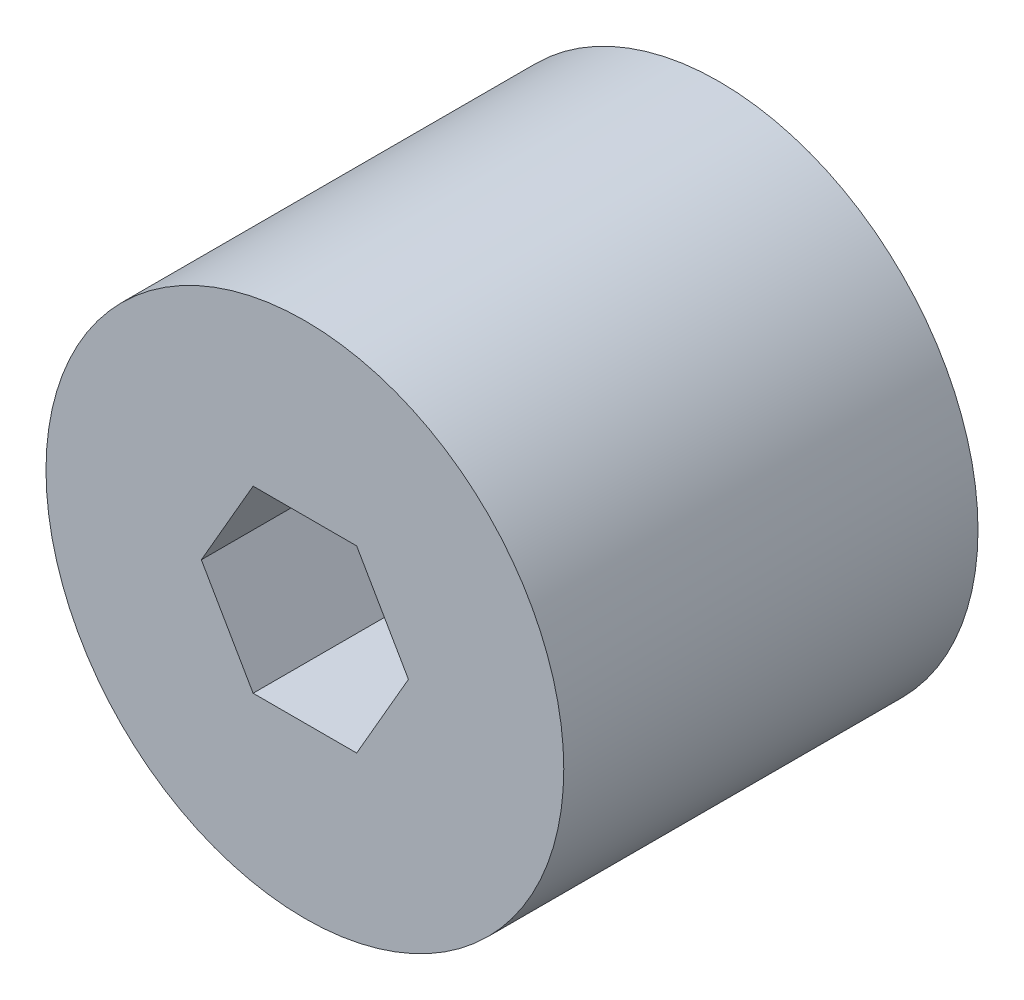
ISO-10303-21;
HEADER;
FILE_DESCRIPTION(('STEP AP214'),'2;1');
FILE_NAME('part.step','',(''),(''),'','','');
FILE_SCHEMA(('AUTOMOTIVE_DESIGN { 1 0 10303 214 1 1 1 1 }'));
ENDSEC;
DATA;
#1=APPLICATION_CONTEXT('core data for automotive mechanical design processes');
#2=APPLICATION_PROTOCOL_DEFINITION('international standard','automotive_design',2000,#1);
#3=PRODUCT_CONTEXT('',#1,'mechanical');
#4=PRODUCT('Part','Part','',(#3));
#5=PRODUCT_RELATED_PRODUCT_CATEGORY('part','',(#4));
#6=PRODUCT_DEFINITION_FORMATION('','',#4);
#7=PRODUCT_DEFINITION_CONTEXT('part definition',#1,'design');
#8=PRODUCT_DEFINITION('design','',#6,#7);
#9=PRODUCT_DEFINITION_SHAPE('','',#8);
#10=(LENGTH_UNIT() NAMED_UNIT(*) SI_UNIT(.MILLI.,.METRE.));
#11=(NAMED_UNIT(*) PLANE_ANGLE_UNIT() SI_UNIT($,.RADIAN.));
#12=(NAMED_UNIT(*) SI_UNIT($,.STERADIAN.) SOLID_ANGLE_UNIT());
#13=UNCERTAINTY_MEASURE_WITH_UNIT(LENGTH_MEASURE(1.E-05),#10,'distance_accuracy_value','');
#14=(GEOMETRIC_REPRESENTATION_CONTEXT(3) GLOBAL_UNCERTAINTY_ASSIGNED_CONTEXT((#13)) GLOBAL_UNIT_ASSIGNED_CONTEXT((#10,
#11,#12)) REPRESENTATION_CONTEXT('',''));
#15=CARTESIAN_POINT('',(0.,0.,0.));
#16=DIRECTION('',(0.,0.,1.));
#17=DIRECTION('',(1.,0.,0.));
#18=AXIS2_PLACEMENT_3D('',#15,#16,#17);
#19=CARTESIAN_POINT('',(0.,0.,25.4));
#20=DIRECTION('',(0.,0.,-1.));
#21=DIRECTION('',(-1.,0.,0.));
#22=AXIS2_PLACEMENT_3D('',#19,#20,#21);
#23=CYLINDRICAL_SURFACE('',#22,15.875);
#24=CARTESIAN_POINT('',(0.,0.,25.4));
#25=DIRECTION('',(0.,0.,1.));
#26=DIRECTION('',(1.,0.,0.));
#27=AXIS2_PLACEMENT_3D('',#24,#25,#26);
#28=CIRCLE('',#27,15.875);
#29=CARTESIAN_POINT('',(15.875,0.,25.4));
#30=VERTEX_POINT('',#29);
#31=EDGE_CURVE('E11',#30,#30,#28,.T.);
#32=ORIENTED_EDGE('',*,*,#31,.F.);
#33=EDGE_LOOP('',(#32));
#34=FACE_BOUND('',#33,.T.);
#35=CARTESIAN_POINT('',(0.,0.,0.));
#36=DIRECTION('',(0.,0.,1.));
#37=DIRECTION('',(1.,0.,0.));
#38=AXIS2_PLACEMENT_3D('',#35,#36,#37);
#39=CIRCLE('',#38,15.875);
#40=CARTESIAN_POINT('',(15.875,0.,0.));
#41=VERTEX_POINT('',#40);
#42=EDGE_CURVE('E42',#41,#41,#39,.T.);
#43=ORIENTED_EDGE('',*,*,#42,.T.);
#44=EDGE_LOOP('',(#43));
#45=FACE_BOUND('',#44,.T.);
#46=ADVANCED_FACE('F39',(#34,#45),#23,.T.);
#47=CARTESIAN_POINT('',(0.,0.,25.4));
#48=DIRECTION('',(0.,0.,1.));
#49=DIRECTION('',(1.,0.,0.));
#50=AXIS2_PLACEMENT_3D('',#47,#48,#49);
#51=PLANE('',#50);
#52=DIRECTION('',(0.5,0.866025403784439,0.));
#53=VECTOR('',#52,1.);
#54=CARTESIAN_POINT('',(3.175,-5.49926131403119,25.4));
#55=LINE('',#54,#53);
#56=CARTESIAN_POINT('',(3.175,-5.49926131403119,25.4));
#57=VERTEX_POINT('',#56);
#58=CARTESIAN_POINT('',(6.35,0.,25.4));
#59=VERTEX_POINT('',#58);
#60=EDGE_CURVE('E54',#57,#59,#55,.T.);
#61=ORIENTED_EDGE('',*,*,#60,.F.);
#62=DIRECTION('',(1.,0.,0.));
#63=VECTOR('',#62,1.);
#64=CARTESIAN_POINT('',(-3.175,-5.49926131403119,25.4));
#65=LINE('',#64,#63);
#66=CARTESIAN_POINT('',(-3.175,-5.49926131403119,25.4));
#67=VERTEX_POINT('',#66);
#68=EDGE_CURVE('E114',#67,#57,#65,.T.);
#69=ORIENTED_EDGE('',*,*,#68,.F.);
#70=DIRECTION('',(0.5,-0.866025403784439,0.));
#71=VECTOR('',#70,1.);
#72=CARTESIAN_POINT('',(-6.35,0.,25.4));
#73=LINE('',#72,#71);
#74=CARTESIAN_POINT('',(-6.35,0.,25.4));
#75=VERTEX_POINT('',#74);
#76=EDGE_CURVE('E118',#75,#67,#73,.T.);
#77=ORIENTED_EDGE('',*,*,#76,.F.);
#78=DIRECTION('',(-0.5,-0.866025403784439,0.));
#79=VECTOR('',#78,1.);
#80=CARTESIAN_POINT('',(-3.175,5.49926131403119,25.4));
#81=LINE('',#80,#79);
#82=CARTESIAN_POINT('',(-3.175,5.49926131403119,25.4));
#83=VERTEX_POINT('',#82);
#84=EDGE_CURVE('E141',#83,#75,#81,.T.);
#85=ORIENTED_EDGE('',*,*,#84,.F.);
#86=DIRECTION('',(-1.,0.,0.));
#87=VECTOR('',#86,1.);
#88=CARTESIAN_POINT('',(3.175,5.49926131403119,25.4));
#89=LINE('',#88,#87);
#90=CARTESIAN_POINT('',(3.175,5.49926131403119,25.4));
#91=VERTEX_POINT('',#90);
#92=EDGE_CURVE('E137',#91,#83,#89,.T.);
#93=ORIENTED_EDGE('',*,*,#92,.F.);
#94=DIRECTION('',(-0.5,0.866025403784438,0.));
#95=VECTOR('',#94,1.);
#96=CARTESIAN_POINT('',(6.35,0.,25.4));
#97=LINE('',#96,#95);
#98=EDGE_CURVE('E134',#59,#91,#97,.T.);
#99=ORIENTED_EDGE('',*,*,#98,.F.);
#100=EDGE_LOOP('',(#61,#69,#77,#85,#93,#99));
#101=FACE_BOUND('',#100,.T.);
#102=ORIENTED_EDGE('',*,*,#31,.T.);
#103=EDGE_LOOP('',(#102));
#104=FACE_BOUND('',#103,.T.);
#105=ADVANCED_FACE('F165',(#101,#104),#51,.T.);
#106=CARTESIAN_POINT('',(0.,0.,0.));
#107=DIRECTION('',(0.,0.,1.));
#108=DIRECTION('',(1.,0.,0.));
#109=AXIS2_PLACEMENT_3D('',#106,#107,#108);
#110=PLANE('',#109);
#111=DIRECTION('',(1.,0.,0.));
#112=VECTOR('',#111,1.);
#113=CARTESIAN_POINT('',(-3.175,-5.49926131403119,0.));
#114=LINE('',#113,#112);
#115=CARTESIAN_POINT('',(-3.175,-5.49926131403119,0.));
#116=VERTEX_POINT('',#115);
#117=CARTESIAN_POINT('',(3.175,-5.49926131403119,0.));
#118=VERTEX_POINT('',#117);
#119=EDGE_CURVE('E101',#116,#118,#114,.T.);
#120=ORIENTED_EDGE('',*,*,#119,.T.);
#121=DIRECTION('',(0.5,0.866025403784439,0.));
#122=VECTOR('',#121,1.);
#123=CARTESIAN_POINT('',(3.175,-5.49926131403119,0.));
#124=LINE('',#123,#122);
#125=CARTESIAN_POINT('',(6.35,0.,0.));
#126=VERTEX_POINT('',#125);
#127=EDGE_CURVE('E94',#118,#126,#124,.T.);
#128=ORIENTED_EDGE('',*,*,#127,.T.);
#129=DIRECTION('',(-0.5,0.866025403784438,0.));
#130=VECTOR('',#129,1.);
#131=CARTESIAN_POINT('',(6.35,0.,0.));
#132=LINE('',#131,#130);
#133=CARTESIAN_POINT('',(3.175,5.49926131403119,0.));
#134=VERTEX_POINT('',#133);
#135=EDGE_CURVE('E104',#126,#134,#132,.T.);
#136=ORIENTED_EDGE('',*,*,#135,.T.);
#137=DIRECTION('',(-1.,0.,0.));
#138=VECTOR('',#137,1.);
#139=CARTESIAN_POINT('',(3.175,5.49926131403119,0.));
#140=LINE('',#139,#138);
#141=CARTESIAN_POINT('',(-3.175,5.49926131403119,0.));
#142=VERTEX_POINT('',#141);
#143=EDGE_CURVE('E62',#134,#142,#140,.T.);
#144=ORIENTED_EDGE('',*,*,#143,.T.);
#145=DIRECTION('',(-0.5,-0.866025403784439,0.));
#146=VECTOR('',#145,1.);
#147=CARTESIAN_POINT('',(-3.175,5.49926131403119,0.));
#148=LINE('',#147,#146);
#149=CARTESIAN_POINT('',(-6.35,0.,0.));
#150=VERTEX_POINT('',#149);
#151=EDGE_CURVE('E123',#142,#150,#148,.T.);
#152=ORIENTED_EDGE('',*,*,#151,.T.);
#153=DIRECTION('',(0.5,-0.866025403784439,0.));
#154=VECTOR('',#153,1.);
#155=CARTESIAN_POINT('',(-6.35,0.,0.));
#156=LINE('',#155,#154);
#157=EDGE_CURVE('E127',#150,#116,#156,.T.);
#158=ORIENTED_EDGE('',*,*,#157,.T.);
#159=EDGE_LOOP('',(#120,#128,#136,#144,#152,#158));
#160=FACE_BOUND('',#159,.T.);
#161=ORIENTED_EDGE('',*,*,#42,.F.);
#162=EDGE_LOOP('',(#161));
#163=FACE_BOUND('',#162,.T.);
#164=ADVANCED_FACE('F109',(#160,#163),#110,.F.);
#165=CARTESIAN_POINT('',(3.175,-5.49926131403119,0.));
#166=DIRECTION('',(0.866025403784439,-0.5,0.));
#167=DIRECTION('',(0.5,0.866025403784439,0.));
#168=AXIS2_PLACEMENT_3D('',#165,#166,#167);
#169=PLANE('',#168);
#170=ORIENTED_EDGE('',*,*,#60,.T.);
#171=DIRECTION('',(0.,0.,1.));
#172=VECTOR('',#171,1.);
#173=CARTESIAN_POINT('',(6.35,0.,0.));
#174=LINE('',#173,#172);
#175=EDGE_CURVE('E90',#126,#59,#174,.T.);
#176=ORIENTED_EDGE('',*,*,#175,.F.);
#177=ORIENTED_EDGE('',*,*,#127,.F.);
#178=DIRECTION('',(0.,0.,1.));
#179=VECTOR('',#178,1.);
#180=CARTESIAN_POINT('',(3.175,-5.49926131403119,0.));
#181=LINE('',#180,#179);
#182=EDGE_CURVE('E148',#118,#57,#181,.T.);
#183=ORIENTED_EDGE('',*,*,#182,.T.);
#184=EDGE_LOOP('',(#170,#176,#177,#183));
#185=FACE_BOUND('',#184,.T.);
#186=ADVANCED_FACE('F92',(#185),#169,.F.);
#187=CARTESIAN_POINT('',(-3.175,-5.49926131403119,0.));
#188=DIRECTION('',(0.,-1.,0.));
#189=DIRECTION('',(0.,0.,-1.));
#190=AXIS2_PLACEMENT_3D('',#187,#188,#189);
#191=PLANE('',#190);
#192=ORIENTED_EDGE('',*,*,#68,.T.);
#193=ORIENTED_EDGE('',*,*,#182,.F.);
#194=ORIENTED_EDGE('',*,*,#119,.F.);
#195=DIRECTION('',(0.,0.,1.));
#196=VECTOR('',#195,1.);
#197=CARTESIAN_POINT('',(-3.175,-5.49926131403119,0.));
#198=LINE('',#197,#196);
#199=EDGE_CURVE('E151',#116,#67,#198,.T.);
#200=ORIENTED_EDGE('',*,*,#199,.T.);
#201=EDGE_LOOP('',(#192,#193,#194,#200));
#202=FACE_BOUND('',#201,.T.);
#203=ADVANCED_FACE('F176',(#202),#191,.F.);
#204=CARTESIAN_POINT('',(-6.35,0.,0.));
#205=DIRECTION('',(-0.866025403784439,-0.5,0.));
#206=DIRECTION('',(0.5,-0.866025403784439,0.));
#207=AXIS2_PLACEMENT_3D('',#204,#205,#206);
#208=PLANE('',#207);
#209=ORIENTED_EDGE('',*,*,#76,.T.);
#210=ORIENTED_EDGE('',*,*,#199,.F.);
#211=ORIENTED_EDGE('',*,*,#157,.F.);
#212=DIRECTION('',(0.,0.,1.));
#213=VECTOR('',#212,1.);
#214=CARTESIAN_POINT('',(-6.35,0.,0.));
#215=LINE('',#214,#213);
#216=EDGE_CURVE('E154',#150,#75,#215,.T.);
#217=ORIENTED_EDGE('',*,*,#216,.T.);
#218=EDGE_LOOP('',(#209,#210,#211,#217));
#219=FACE_BOUND('',#218,.T.);
#220=ADVANCED_FACE('F174',(#219),#208,.F.);
#221=CARTESIAN_POINT('',(-3.175,5.49926131403119,0.));
#222=DIRECTION('',(-0.866025403784439,0.5,0.));
#223=DIRECTION('',(-0.5,-0.866025403784439,0.));
#224=AXIS2_PLACEMENT_3D('',#221,#222,#223);
#225=PLANE('',#224);
#226=ORIENTED_EDGE('',*,*,#84,.T.);
#227=ORIENTED_EDGE('',*,*,#216,.F.);
#228=ORIENTED_EDGE('',*,*,#151,.F.);
#229=DIRECTION('',(0.,0.,1.));
#230=VECTOR('',#229,1.);
#231=CARTESIAN_POINT('',(-3.175,5.49926131403119,0.));
#232=LINE('',#231,#230);
#233=EDGE_CURVE('E157',#142,#83,#232,.T.);
#234=ORIENTED_EDGE('',*,*,#233,.T.);
#235=EDGE_LOOP('',(#226,#227,#228,#234));
#236=FACE_BOUND('',#235,.T.);
#237=ADVANCED_FACE('F170',(#236),#225,.F.);
#238=CARTESIAN_POINT('',(3.175,5.49926131403119,0.));
#239=DIRECTION('',(0.,1.,0.));
#240=DIRECTION('',(0.,0.,1.));
#241=AXIS2_PLACEMENT_3D('',#238,#239,#240);
#242=PLANE('',#241);
#243=ORIENTED_EDGE('',*,*,#92,.T.);
#244=ORIENTED_EDGE('',*,*,#233,.F.);
#245=ORIENTED_EDGE('',*,*,#143,.F.);
#246=DIRECTION('',(0.,0.,1.));
#247=VECTOR('',#246,1.);
#248=CARTESIAN_POINT('',(3.175,5.49926131403119,0.));
#249=LINE('',#248,#247);
#250=EDGE_CURVE('E100',#134,#91,#249,.T.);
#251=ORIENTED_EDGE('',*,*,#250,.T.);
#252=EDGE_LOOP('',(#243,#244,#245,#251));
#253=FACE_BOUND('',#252,.T.);
#254=ADVANCED_FACE('F161',(#253),#242,.F.);
#255=CARTESIAN_POINT('',(6.35,0.,0.));
#256=DIRECTION('',(0.866025403784439,0.5,0.));
#257=DIRECTION('',(-0.5,0.866025403784439,0.));
#258=AXIS2_PLACEMENT_3D('',#255,#256,#257);
#259=PLANE('',#258);
#260=ORIENTED_EDGE('',*,*,#98,.T.);
#261=ORIENTED_EDGE('',*,*,#250,.F.);
#262=ORIENTED_EDGE('',*,*,#135,.F.);
#263=ORIENTED_EDGE('',*,*,#175,.T.);
#264=EDGE_LOOP('',(#260,#261,#262,#263));
#265=FACE_BOUND('',#264,.T.);
#266=ADVANCED_FACE('F105',(#265),#259,.F.);
#267=CLOSED_SHELL('',(#46,#105,#164,#186,#203,#220,#237,#254,#266));
#268=MANIFOLD_SOLID_BREP('B2',#267);
#269=ADVANCED_BREP_SHAPE_REPRESENTATION('',(#18,#268),#14);
#270=SHAPE_DEFINITION_REPRESENTATION(#9,#269);
ENDSEC;
END-ISO-10303-21;
